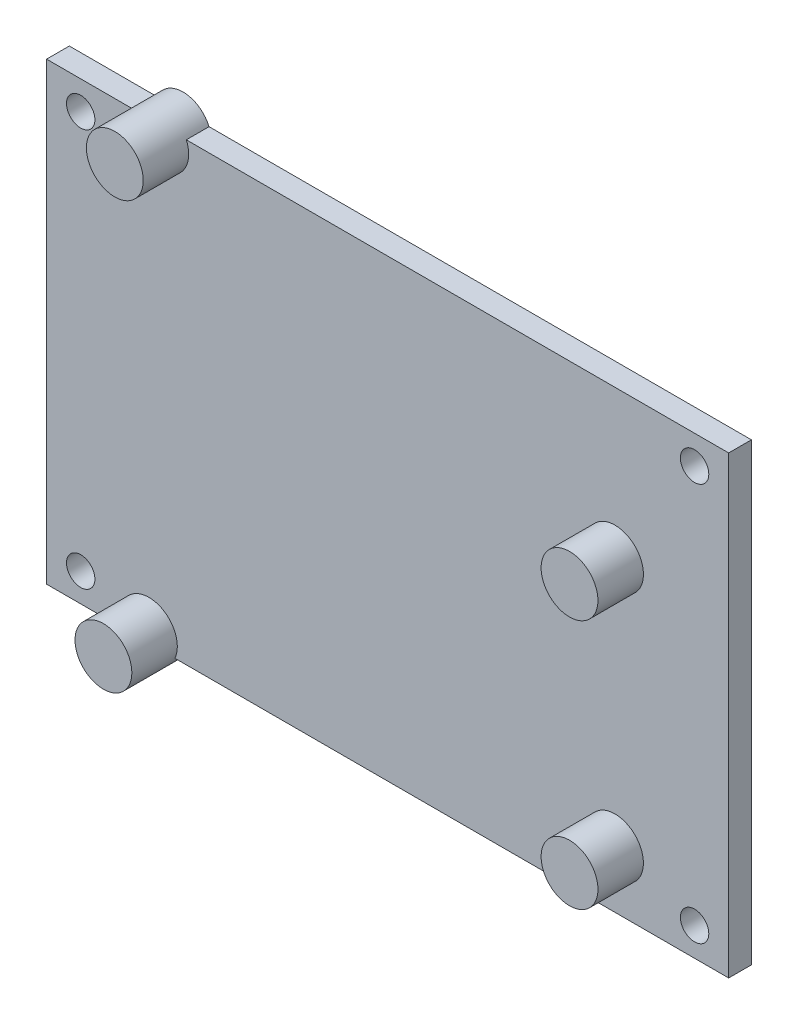
ISO-10303-21;
HEADER;
FILE_DESCRIPTION(('STEP AP214'),'2;1');
FILE_NAME('part.step','',(''),(''),'','','');
FILE_SCHEMA(('AUTOMOTIVE_DESIGN { 1 0 10303 214 1 1 1 1 }'));
ENDSEC;
DATA;
#1=APPLICATION_CONTEXT('core data for automotive mechanical design processes');
#2=APPLICATION_PROTOCOL_DEFINITION('international standard','automotive_design',2000,#1);
#3=PRODUCT_CONTEXT('',#1,'mechanical');
#4=PRODUCT('Part','Part','',(#3));
#5=PRODUCT_RELATED_PRODUCT_CATEGORY('part','',(#4));
#6=PRODUCT_DEFINITION_FORMATION('','',#4);
#7=PRODUCT_DEFINITION_CONTEXT('part definition',#1,'design');
#8=PRODUCT_DEFINITION('design','',#6,#7);
#9=PRODUCT_DEFINITION_SHAPE('','',#8);
#10=(LENGTH_UNIT() NAMED_UNIT(*) SI_UNIT(.MILLI.,.METRE.));
#11=(NAMED_UNIT(*) PLANE_ANGLE_UNIT() SI_UNIT($,.RADIAN.));
#12=(NAMED_UNIT(*) SI_UNIT($,.STERADIAN.) SOLID_ANGLE_UNIT());
#13=UNCERTAINTY_MEASURE_WITH_UNIT(LENGTH_MEASURE(1.E-05),#10,'distance_accuracy_value','');
#14=(GEOMETRIC_REPRESENTATION_CONTEXT(3) GLOBAL_UNCERTAINTY_ASSIGNED_CONTEXT((#13)) GLOBAL_UNIT_ASSIGNED_CONTEXT((#10,
#11,#12)) REPRESENTATION_CONTEXT('',''));
#15=CARTESIAN_POINT('',(0.,0.,0.));
#16=DIRECTION('',(0.,0.,1.));
#17=DIRECTION('',(1.,0.,0.));
#18=AXIS2_PLACEMENT_3D('',#15,#16,#17);
#19=CARTESIAN_POINT('',(-38.1,-25.4,2.54));
#20=DIRECTION('',(0.,1.,0.));
#21=DIRECTION('',(0.,0.,1.));
#22=AXIS2_PLACEMENT_3D('',#19,#20,#21);
#23=PLANE('',#22);
#24=DIRECTION('',(1.,0.,0.));
#25=VECTOR('',#24,1.);
#26=CARTESIAN_POINT('',(-38.1,-25.4,0.));
#27=LINE('',#26,#25);
#28=CARTESIAN_POINT('',(-38.1,-25.4,0.));
#29=VERTEX_POINT('',#28);
#30=CARTESIAN_POINT('',(-29.579935566297,-25.4,0.));
#31=VERTEX_POINT('',#30);
#32=EDGE_CURVE('E109',#29,#31,#27,.T.);
#33=ORIENTED_EDGE('',*,*,#32,.T.);
#34=DIRECTION('',(0.,0.,1.));
#35=VECTOR('',#34,1.);
#36=CARTESIAN_POINT('',(-29.579935566297,-25.4,0.));
#37=LINE('',#36,#35);
#38=CARTESIAN_POINT('',(-29.579935566297,-25.4,2.54));
#39=VERTEX_POINT('',#38);
#40=EDGE_CURVE('E11',#31,#39,#37,.T.);
#41=ORIENTED_EDGE('',*,*,#40,.T.);
#42=DIRECTION('',(1.,0.,0.));
#43=VECTOR('',#42,1.);
#44=CARTESIAN_POINT('',(-38.1,-25.4,2.54));
#45=LINE('',#44,#43);
#46=CARTESIAN_POINT('',(-38.1,-25.4,2.54));
#47=VERTEX_POINT('',#46);
#48=EDGE_CURVE('E167',#47,#39,#45,.T.);
#49=ORIENTED_EDGE('',*,*,#48,.F.);
#50=DIRECTION('',(0.,0.,-1.));
#51=VECTOR('',#50,1.);
#52=CARTESIAN_POINT('',(-38.1,-25.4,2.54));
#53=LINE('',#52,#51);
#54=EDGE_CURVE('E176',#47,#29,#53,.T.);
#55=ORIENTED_EDGE('',*,*,#54,.T.);
#56=EDGE_LOOP('',(#33,#41,#49,#55));
#57=FACE_BOUND('',#56,.T.);
#58=ADVANCED_FACE('F33',(#57),#23,.F.);
#59=CARTESIAN_POINT('',(-38.1,25.4,2.54));
#60=DIRECTION('',(0.,-1.,0.));
#61=DIRECTION('',(0.,0.,-1.));
#62=AXIS2_PLACEMENT_3D('',#59,#60,#61);
#63=PLANE('',#62);
#64=DIRECTION('',(-1.,0.,0.));
#65=VECTOR('',#64,1.);
#66=CARTESIAN_POINT('',(-38.1,25.4,0.));
#67=LINE('',#66,#65);
#68=CARTESIAN_POINT('',(38.1,25.4,0.));
#69=VERTEX_POINT('',#68);
#70=CARTESIAN_POINT('',(-22.490064433703,25.4,0.));
#71=VERTEX_POINT('',#70);
#72=EDGE_CURVE('E172',#69,#71,#67,.T.);
#73=ORIENTED_EDGE('',*,*,#72,.T.);
#74=DIRECTION('',(0.,0.,1.));
#75=VECTOR('',#74,1.);
#76=CARTESIAN_POINT('',(-22.490064433703,25.4,0.));
#77=LINE('',#76,#75);
#78=CARTESIAN_POINT('',(-22.490064433703,25.4,2.54));
#79=VERTEX_POINT('',#78);
#80=EDGE_CURVE('E116',#71,#79,#77,.T.);
#81=ORIENTED_EDGE('',*,*,#80,.T.);
#82=DIRECTION('',(-1.,0.,0.));
#83=VECTOR('',#82,1.);
#84=CARTESIAN_POINT('',(-38.1,25.4,2.54));
#85=LINE('',#84,#83);
#86=CARTESIAN_POINT('',(38.1,25.4,2.54));
#87=VERTEX_POINT('',#86);
#88=EDGE_CURVE('E162',#87,#79,#85,.T.);
#89=ORIENTED_EDGE('',*,*,#88,.F.);
#90=DIRECTION('',(0.,0.,-1.));
#91=VECTOR('',#90,1.);
#92=CARTESIAN_POINT('',(38.1,25.4,2.54));
#93=LINE('',#92,#91);
#94=EDGE_CURVE('E182',#87,#69,#93,.T.);
#95=ORIENTED_EDGE('',*,*,#94,.T.);
#96=EDGE_LOOP('',(#73,#81,#89,#95));
#97=FACE_BOUND('',#96,.T.);
#98=ADVANCED_FACE('F190',(#97),#63,.F.);
#99=CARTESIAN_POINT('',(0.,0.,2.54));
#100=DIRECTION('',(0.,0.,-1.));
#101=DIRECTION('',(-1.,0.,0.));
#102=AXIS2_PLACEMENT_3D('',#99,#100,#101);
#103=PLANE('',#102);
#104=CARTESIAN_POINT('',(25.4,-19.05,2.54));
#105=DIRECTION('',(0.,0.,-1.));
#106=DIRECTION('',(-1.,0.,0.));
#107=AXIS2_PLACEMENT_3D('',#104,#105,#106);
#108=CIRCLE('',#107,3.175);
#109=CARTESIAN_POINT('',(22.225,-19.05,2.54));
#110=VERTEX_POINT('',#109);
#111=EDGE_CURVE('E286',#110,#110,#108,.T.);
#112=ORIENTED_EDGE('',*,*,#111,.T.);
#113=EDGE_LOOP('',(#112));
#114=FACE_BOUND('',#113,.T.);
#115=CARTESIAN_POINT('',(25.4,8.89000000000001,2.54));
#116=DIRECTION('',(0.,0.,-1.));
#117=DIRECTION('',(-1.,0.,0.));
#118=AXIS2_PLACEMENT_3D('',#115,#116,#117);
#119=CIRCLE('',#118,3.17500000000001);
#120=CARTESIAN_POINT('',(22.225,8.89000000000001,2.54));
#121=VERTEX_POINT('',#120);
#122=EDGE_CURVE('E123',#121,#121,#119,.T.);
#123=ORIENTED_EDGE('',*,*,#122,.T.);
#124=EDGE_LOOP('',(#123));
#125=FACE_BOUND('',#124,.T.);
#126=ORIENTED_EDGE('',*,*,#48,.T.);
#127=CARTESIAN_POINT('',(-26.67,-24.13,2.54));
#128=DIRECTION('',(0.,0.,-1.));
#129=DIRECTION('',(-1.,0.,0.));
#130=AXIS2_PLACEMENT_3D('',#127,#128,#129);
#131=CIRCLE('',#130,3.175);
#132=CARTESIAN_POINT('',(-23.760064433703,-25.4,2.54));
#133=VERTEX_POINT('',#132);
#134=EDGE_CURVE('E48',#39,#133,#131,.T.);
#135=ORIENTED_EDGE('',*,*,#134,.T.);
#136=CARTESIAN_POINT('',(38.1,-25.4,2.54));
#137=VERTEX_POINT('',#136);
#138=EDGE_CURVE('E114',#133,#137,#45,.T.);
#139=ORIENTED_EDGE('',*,*,#138,.T.);
#140=DIRECTION('',(0.,1.,0.));
#141=VECTOR('',#140,1.);
#142=CARTESIAN_POINT('',(38.1,-25.4,2.54));
#143=LINE('',#142,#141);
#144=EDGE_CURVE('E158',#137,#87,#143,.T.);
#145=ORIENTED_EDGE('',*,*,#144,.T.);
#146=ORIENTED_EDGE('',*,*,#88,.T.);
#147=CARTESIAN_POINT('',(-25.4,24.13,2.54));
#148=DIRECTION('',(0.,0.,-1.));
#149=DIRECTION('',(-1.,0.,0.));
#150=AXIS2_PLACEMENT_3D('',#147,#148,#149);
#151=CIRCLE('',#150,3.175);
#152=CARTESIAN_POINT('',(-28.309935566297,25.4,2.54));
#153=VERTEX_POINT('',#152);
#154=EDGE_CURVE('E132',#79,#153,#151,.T.);
#155=ORIENTED_EDGE('',*,*,#154,.T.);
#156=CARTESIAN_POINT('',(-38.1,25.4,2.54));
#157=VERTEX_POINT('',#156);
#158=EDGE_CURVE('E161',#153,#157,#85,.T.);
#159=ORIENTED_EDGE('',*,*,#158,.T.);
#160=DIRECTION('',(0.,-1.,0.));
#161=VECTOR('',#160,1.);
#162=CARTESIAN_POINT('',(-38.1,-25.4,2.54));
#163=LINE('',#162,#161);
#164=EDGE_CURVE('E165',#157,#47,#163,.T.);
#165=ORIENTED_EDGE('',*,*,#164,.T.);
#166=EDGE_LOOP('',(#126,#135,#139,#145,#146,#155,#159,#165));
#167=FACE_BOUND('',#166,.T.);
#168=CARTESIAN_POINT('',(-34.29,22.225,2.54));
#169=DIRECTION('',(0.,0.,1.));
#170=DIRECTION('',(1.,0.,0.));
#171=AXIS2_PLACEMENT_3D('',#168,#169,#170);
#172=CIRCLE('',#171,1.5875);
#173=CARTESIAN_POINT('',(-32.7025,22.225,2.54));
#174=VERTEX_POINT('',#173);
#175=EDGE_CURVE('E153',#174,#174,#172,.T.);
#176=ORIENTED_EDGE('',*,*,#175,.F.);
#177=EDGE_LOOP('',(#176));
#178=FACE_BOUND('',#177,.T.);
#179=CARTESIAN_POINT('',(34.29,22.225,2.54));
#180=DIRECTION('',(0.,0.,1.));
#181=DIRECTION('',(1.,0.,0.));
#182=AXIS2_PLACEMENT_3D('',#179,#180,#181);
#183=CIRCLE('',#182,1.5875);
#184=CARTESIAN_POINT('',(35.8775,22.225,2.54));
#185=VERTEX_POINT('',#184);
#186=EDGE_CURVE('E147',#185,#185,#183,.T.);
#187=ORIENTED_EDGE('',*,*,#186,.F.);
#188=EDGE_LOOP('',(#187));
#189=FACE_BOUND('',#188,.T.);
#190=CARTESIAN_POINT('',(34.2900000000005,-22.225,2.54));
#191=DIRECTION('',(0.,0.,1.));
#192=DIRECTION('',(1.,0.,0.));
#193=AXIS2_PLACEMENT_3D('',#190,#191,#192);
#194=CIRCLE('',#193,1.5875);
#195=CARTESIAN_POINT('',(35.8775000000005,-22.225,2.54));
#196=VERTEX_POINT('',#195);
#197=EDGE_CURVE('E141',#196,#196,#194,.T.);
#198=ORIENTED_EDGE('',*,*,#197,.F.);
#199=EDGE_LOOP('',(#198));
#200=FACE_BOUND('',#199,.T.);
#201=CARTESIAN_POINT('',(-34.2899999999995,-22.225,2.54));
#202=DIRECTION('',(0.,0.,1.));
#203=DIRECTION('',(1.,0.,0.));
#204=AXIS2_PLACEMENT_3D('',#201,#202,#203);
#205=CIRCLE('',#204,1.5875);
#206=CARTESIAN_POINT('',(-32.7024999999995,-22.225,2.54));
#207=VERTEX_POINT('',#206);
#208=EDGE_CURVE('E135',#207,#207,#205,.T.);
#209=ORIENTED_EDGE('',*,*,#208,.F.);
#210=EDGE_LOOP('',(#209));
#211=FACE_BOUND('',#210,.T.);
#212=ADVANCED_FACE('F194',(#114,#125,#167,#178,#189,#200,#211),#103,.F.);
#213=CARTESIAN_POINT('',(0.,0.,0.));
#214=DIRECTION('',(0.,0.,-1.));
#215=DIRECTION('',(-1.,0.,0.));
#216=AXIS2_PLACEMENT_3D('',#213,#214,#215);
#217=PLANE('',#216);
#218=CARTESIAN_POINT('',(-23.760064433703,-25.4,0.));
#219=VERTEX_POINT('',#218);
#220=CARTESIAN_POINT('',(38.1,-25.4,0.));
#221=VERTEX_POINT('',#220);
#222=EDGE_CURVE('E97',#219,#221,#27,.T.);
#223=ORIENTED_EDGE('',*,*,#222,.F.);
#224=CARTESIAN_POINT('',(-26.67,-24.13,0.));
#225=DIRECTION('',(0.,0.,1.));
#226=DIRECTION('',(1.,0.,0.));
#227=AXIS2_PLACEMENT_3D('',#224,#225,#226);
#228=CIRCLE('',#227,3.175);
#229=EDGE_CURVE('E103',#31,#219,#228,.T.);
#230=ORIENTED_EDGE('',*,*,#229,.F.);
#231=ORIENTED_EDGE('',*,*,#32,.F.);
#232=DIRECTION('',(0.,-1.,0.));
#233=VECTOR('',#232,1.);
#234=CARTESIAN_POINT('',(-38.1,-25.4,0.));
#235=LINE('',#234,#233);
#236=CARTESIAN_POINT('',(-38.1,25.4,0.));
#237=VERTEX_POINT('',#236);
#238=EDGE_CURVE('E110',#237,#29,#235,.T.);
#239=ORIENTED_EDGE('',*,*,#238,.F.);
#240=CARTESIAN_POINT('',(-28.309935566297,25.4,0.));
#241=VERTEX_POINT('',#240);
#242=EDGE_CURVE('E171',#241,#237,#67,.T.);
#243=ORIENTED_EDGE('',*,*,#242,.F.);
#244=CARTESIAN_POINT('',(-25.4,24.13,0.));
#245=DIRECTION('',(0.,0.,1.));
#246=DIRECTION('',(1.,0.,0.));
#247=AXIS2_PLACEMENT_3D('',#244,#245,#246);
#248=CIRCLE('',#247,3.175);
#249=EDGE_CURVE('E129',#71,#241,#248,.T.);
#250=ORIENTED_EDGE('',*,*,#249,.F.);
#251=ORIENTED_EDGE('',*,*,#72,.F.);
#252=DIRECTION('',(0.,1.,0.));
#253=VECTOR('',#252,1.);
#254=CARTESIAN_POINT('',(38.1,-25.4,0.));
#255=LINE('',#254,#253);
#256=EDGE_CURVE('E105',#221,#69,#255,.T.);
#257=ORIENTED_EDGE('',*,*,#256,.F.);
#258=EDGE_LOOP('',(#223,#230,#231,#239,#243,#250,#251,#257));
#259=FACE_BOUND('',#258,.T.);
#260=CARTESIAN_POINT('',(34.2900000000005,-22.225,0.));
#261=DIRECTION('',(0.,0.,1.));
#262=DIRECTION('',(1.,0.,0.));
#263=AXIS2_PLACEMENT_3D('',#260,#261,#262);
#264=CIRCLE('',#263,1.5875);
#265=CARTESIAN_POINT('',(35.8775000000005,-22.225,0.));
#266=VERTEX_POINT('',#265);
#267=EDGE_CURVE('E138',#266,#266,#264,.T.);
#268=ORIENTED_EDGE('',*,*,#267,.T.);
#269=EDGE_LOOP('',(#268));
#270=FACE_BOUND('',#269,.T.);
#271=CARTESIAN_POINT('',(-34.29,22.225,0.));
#272=DIRECTION('',(0.,0.,1.));
#273=DIRECTION('',(1.,0.,0.));
#274=AXIS2_PLACEMENT_3D('',#271,#272,#273);
#275=CIRCLE('',#274,1.5875);
#276=CARTESIAN_POINT('',(-32.7025,22.225,0.));
#277=VERTEX_POINT('',#276);
#278=EDGE_CURVE('E150',#277,#277,#275,.T.);
#279=ORIENTED_EDGE('',*,*,#278,.T.);
#280=EDGE_LOOP('',(#279));
#281=FACE_BOUND('',#280,.T.);
#282=CARTESIAN_POINT('',(34.29,22.225,0.));
#283=DIRECTION('',(0.,0.,1.));
#284=DIRECTION('',(1.,0.,0.));
#285=AXIS2_PLACEMENT_3D('',#282,#283,#284);
#286=CIRCLE('',#285,1.5875);
#287=CARTESIAN_POINT('',(35.8775,22.225,0.));
#288=VERTEX_POINT('',#287);
#289=EDGE_CURVE('E144',#288,#288,#286,.T.);
#290=ORIENTED_EDGE('',*,*,#289,.T.);
#291=EDGE_LOOP('',(#290));
#292=FACE_BOUND('',#291,.T.);
#293=CARTESIAN_POINT('',(-34.2899999999995,-22.225,0.));
#294=DIRECTION('',(0.,0.,1.));
#295=DIRECTION('',(1.,0.,0.));
#296=AXIS2_PLACEMENT_3D('',#293,#294,#295);
#297=CIRCLE('',#296,1.5875);
#298=CARTESIAN_POINT('',(-32.7024999999995,-22.225,0.));
#299=VERTEX_POINT('',#298);
#300=EDGE_CURVE('E134',#299,#299,#297,.T.);
#301=ORIENTED_EDGE('',*,*,#300,.T.);
#302=EDGE_LOOP('',(#301));
#303=FACE_BOUND('',#302,.T.);
#304=ADVANCED_FACE('F99',(#259,#270,#281,#292,#303),#217,.T.);
#305=CARTESIAN_POINT('',(38.1,-25.4,2.54));
#306=DIRECTION('',(-1.,0.,0.));
#307=DIRECTION('',(0.,0.,1.));
#308=AXIS2_PLACEMENT_3D('',#305,#306,#307);
#309=PLANE('',#308);
#310=ORIENTED_EDGE('',*,*,#256,.T.);
#311=ORIENTED_EDGE('',*,*,#94,.F.);
#312=ORIENTED_EDGE('',*,*,#144,.F.);
#313=DIRECTION('',(0.,0.,-1.));
#314=VECTOR('',#313,1.);
#315=CARTESIAN_POINT('',(38.1,-25.4,2.54));
#316=LINE('',#315,#314);
#317=EDGE_CURVE('E169',#137,#221,#316,.T.);
#318=ORIENTED_EDGE('',*,*,#317,.T.);
#319=EDGE_LOOP('',(#310,#311,#312,#318));
#320=FACE_BOUND('',#319,.T.);
#321=ADVANCED_FACE('F35',(#320),#309,.F.);
#322=ORIENTED_EDGE('',*,*,#158,.F.);
#323=DIRECTION('',(0.,0.,1.));
#324=VECTOR('',#323,1.);
#325=CARTESIAN_POINT('',(-28.309935566297,25.4,0.));
#326=LINE('',#325,#324);
#327=EDGE_CURVE('E185',#153,#241,#326,.F.);
#328=ORIENTED_EDGE('',*,*,#327,.T.);
#329=ORIENTED_EDGE('',*,*,#242,.T.);
#330=DIRECTION('',(0.,0.,-1.));
#331=VECTOR('',#330,1.);
#332=CARTESIAN_POINT('',(-38.1,25.4,2.54));
#333=LINE('',#332,#331);
#334=EDGE_CURVE('E179',#157,#237,#333,.T.);
#335=ORIENTED_EDGE('',*,*,#334,.F.);
#336=EDGE_LOOP('',(#322,#328,#329,#335));
#337=FACE_BOUND('',#336,.T.);
#338=ADVANCED_FACE('F202',(#337),#63,.F.);
#339=CARTESIAN_POINT('',(-38.1,-25.4,2.54));
#340=DIRECTION('',(1.,0.,0.));
#341=DIRECTION('',(0.,0.,-1.));
#342=AXIS2_PLACEMENT_3D('',#339,#340,#341);
#343=PLANE('',#342);
#344=ORIENTED_EDGE('',*,*,#238,.T.);
#345=ORIENTED_EDGE('',*,*,#54,.F.);
#346=ORIENTED_EDGE('',*,*,#164,.F.);
#347=ORIENTED_EDGE('',*,*,#334,.T.);
#348=EDGE_LOOP('',(#344,#345,#346,#347));
#349=FACE_BOUND('',#348,.T.);
#350=ADVANCED_FACE('F207',(#349),#343,.F.);
#351=ORIENTED_EDGE('',*,*,#138,.F.);
#352=DIRECTION('',(0.,0.,1.));
#353=VECTOR('',#352,1.);
#354=CARTESIAN_POINT('',(-23.760064433703,-25.4,0.));
#355=LINE('',#354,#353);
#356=EDGE_CURVE('E41',#133,#219,#355,.F.);
#357=ORIENTED_EDGE('',*,*,#356,.T.);
#358=ORIENTED_EDGE('',*,*,#222,.T.);
#359=ORIENTED_EDGE('',*,*,#317,.F.);
#360=EDGE_LOOP('',(#351,#357,#358,#359));
#361=FACE_BOUND('',#360,.T.);
#362=ADVANCED_FACE('F113',(#361),#23,.F.);
#363=CARTESIAN_POINT('',(-34.29,22.225,2.54));
#364=DIRECTION('',(0.,0.,-1.));
#365=DIRECTION('',(-1.,0.,0.));
#366=AXIS2_PLACEMENT_3D('',#363,#364,#365);
#367=CYLINDRICAL_SURFACE('',#366,1.5875);
#368=ORIENTED_EDGE('',*,*,#175,.T.);
#369=EDGE_LOOP('',(#368));
#370=FACE_BOUND('',#369,.T.);
#371=ORIENTED_EDGE('',*,*,#278,.F.);
#372=EDGE_LOOP('',(#371));
#373=FACE_BOUND('',#372,.T.);
#374=ADVANCED_FACE('F217',(#370,#373),#367,.F.);
#375=CARTESIAN_POINT('',(34.29,22.225,2.54));
#376=DIRECTION('',(0.,0.,-1.));
#377=DIRECTION('',(-1.,0.,0.));
#378=AXIS2_PLACEMENT_3D('',#375,#376,#377);
#379=CYLINDRICAL_SURFACE('',#378,1.5875);
#380=ORIENTED_EDGE('',*,*,#186,.T.);
#381=EDGE_LOOP('',(#380));
#382=FACE_BOUND('',#381,.T.);
#383=ORIENTED_EDGE('',*,*,#289,.F.);
#384=EDGE_LOOP('',(#383));
#385=FACE_BOUND('',#384,.T.);
#386=ADVANCED_FACE('F222',(#382,#385),#379,.F.);
#387=CARTESIAN_POINT('',(34.2900000000005,-22.225,2.54));
#388=DIRECTION('',(0.,0.,-1.));
#389=DIRECTION('',(-1.,0.,0.));
#390=AXIS2_PLACEMENT_3D('',#387,#388,#389);
#391=CYLINDRICAL_SURFACE('',#390,1.5875);
#392=ORIENTED_EDGE('',*,*,#197,.T.);
#393=EDGE_LOOP('',(#392));
#394=FACE_BOUND('',#393,.T.);
#395=ORIENTED_EDGE('',*,*,#267,.F.);
#396=EDGE_LOOP('',(#395));
#397=FACE_BOUND('',#396,.T.);
#398=ADVANCED_FACE('F243',(#394,#397),#391,.F.);
#399=CARTESIAN_POINT('',(-34.2899999999995,-22.225,2.54));
#400=DIRECTION('',(0.,0.,-1.));
#401=DIRECTION('',(-1.,0.,0.));
#402=AXIS2_PLACEMENT_3D('',#399,#400,#401);
#403=CYLINDRICAL_SURFACE('',#402,1.5875);
#404=ORIENTED_EDGE('',*,*,#208,.T.);
#405=EDGE_LOOP('',(#404));
#406=FACE_BOUND('',#405,.T.);
#407=ORIENTED_EDGE('',*,*,#300,.F.);
#408=EDGE_LOOP('',(#407));
#409=FACE_BOUND('',#408,.T.);
#410=ADVANCED_FACE('F247',(#406,#409),#403,.F.);
#411=CARTESIAN_POINT('',(-25.4,24.13,0.));
#412=DIRECTION('',(0.,0.,1.));
#413=DIRECTION('',(1.,0.,0.));
#414=AXIS2_PLACEMENT_3D('',#411,#412,#413);
#415=CYLINDRICAL_SURFACE('',#414,3.175);
#416=CARTESIAN_POINT('',(-25.4,24.13,7.62));
#417=DIRECTION('',(0.,0.,1.));
#418=DIRECTION('',(1.,0.,0.));
#419=AXIS2_PLACEMENT_3D('',#416,#417,#418);
#420=CIRCLE('',#419,3.175);
#421=CARTESIAN_POINT('',(-22.225,24.13,7.62));
#422=VERTEX_POINT('',#421);
#423=EDGE_CURVE('E120',#422,#422,#420,.T.);
#424=ORIENTED_EDGE('',*,*,#423,.F.);
#425=EDGE_LOOP('',(#424));
#426=FACE_BOUND('',#425,.T.);
#427=ORIENTED_EDGE('',*,*,#80,.F.);
#428=ORIENTED_EDGE('',*,*,#249,.T.);
#429=ORIENTED_EDGE('',*,*,#327,.F.);
#430=ORIENTED_EDGE('',*,*,#154,.F.);
#431=EDGE_LOOP('',(#427,#428,#429,#430));
#432=FACE_BOUND('',#431,.T.);
#433=ADVANCED_FACE('F200',(#426,#432),#415,.T.);
#434=CARTESIAN_POINT('',(-25.4,24.13,7.62));
#435=DIRECTION('',(0.,0.,1.));
#436=DIRECTION('',(1.,0.,0.));
#437=AXIS2_PLACEMENT_3D('',#434,#435,#436);
#438=PLANE('',#437);
#439=ORIENTED_EDGE('',*,*,#423,.T.);
#440=EDGE_LOOP('',(#439));
#441=FACE_BOUND('',#440,.T.);
#442=ADVANCED_FACE('F254',(#441),#438,.T.);
#443=CARTESIAN_POINT('',(-26.67,-24.13,0.));
#444=DIRECTION('',(0.,0.,1.));
#445=DIRECTION('',(1.,0.,0.));
#446=AXIS2_PLACEMENT_3D('',#443,#444,#445);
#447=CYLINDRICAL_SURFACE('',#446,3.175);
#448=CARTESIAN_POINT('',(-26.67,-24.13,7.62));
#449=DIRECTION('',(0.,0.,1.));
#450=DIRECTION('',(1.,0.,0.));
#451=AXIS2_PLACEMENT_3D('',#448,#449,#450);
#452=CIRCLE('',#451,3.175);
#453=CARTESIAN_POINT('',(-23.495,-24.13,7.62));
#454=VERTEX_POINT('',#453);
#455=EDGE_CURVE('E118',#454,#454,#452,.T.);
#456=ORIENTED_EDGE('',*,*,#455,.F.);
#457=EDGE_LOOP('',(#456));
#458=FACE_BOUND('',#457,.T.);
#459=ORIENTED_EDGE('',*,*,#40,.F.);
#460=ORIENTED_EDGE('',*,*,#229,.T.);
#461=ORIENTED_EDGE('',*,*,#356,.F.);
#462=ORIENTED_EDGE('',*,*,#134,.F.);
#463=EDGE_LOOP('',(#459,#460,#461,#462));
#464=FACE_BOUND('',#463,.T.);
#465=ADVANCED_FACE('F117',(#458,#464),#447,.T.);
#466=CARTESIAN_POINT('',(-26.67,-24.13,7.62));
#467=DIRECTION('',(0.,0.,1.));
#468=DIRECTION('',(1.,0.,0.));
#469=AXIS2_PLACEMENT_3D('',#466,#467,#468);
#470=PLANE('',#469);
#471=ORIENTED_EDGE('',*,*,#455,.T.);
#472=EDGE_LOOP('',(#471));
#473=FACE_BOUND('',#472,.T.);
#474=ADVANCED_FACE('F261',(#473),#470,.T.);
#475=CARTESIAN_POINT('',(25.4,8.89000000000001,0.));
#476=DIRECTION('',(0.,0.,1.));
#477=DIRECTION('',(1.,0.,0.));
#478=AXIS2_PLACEMENT_3D('',#475,#476,#477);
#479=CYLINDRICAL_SURFACE('',#478,3.17500000000001);
#480=CARTESIAN_POINT('',(25.4,8.89000000000001,7.62));
#481=DIRECTION('',(0.,0.,1.));
#482=DIRECTION('',(1.,0.,0.));
#483=AXIS2_PLACEMENT_3D('',#480,#481,#482);
#484=CIRCLE('',#483,3.17500000000001);
#485=CARTESIAN_POINT('',(28.575,8.89000000000001,7.62));
#486=VERTEX_POINT('',#485);
#487=EDGE_CURVE('E289',#486,#486,#484,.T.);
#488=ORIENTED_EDGE('',*,*,#487,.F.);
#489=EDGE_LOOP('',(#488));
#490=FACE_BOUND('',#489,.T.);
#491=ORIENTED_EDGE('',*,*,#122,.F.);
#492=EDGE_LOOP('',(#491));
#493=FACE_BOUND('',#492,.T.);
#494=ADVANCED_FACE('F265',(#490,#493),#479,.T.);
#495=CARTESIAN_POINT('',(25.4,8.89000000000001,7.62));
#496=DIRECTION('',(0.,0.,1.));
#497=DIRECTION('',(1.,0.,0.));
#498=AXIS2_PLACEMENT_3D('',#495,#496,#497);
#499=PLANE('',#498);
#500=ORIENTED_EDGE('',*,*,#487,.T.);
#501=EDGE_LOOP('',(#500));
#502=FACE_BOUND('',#501,.T.);
#503=ADVANCED_FACE('F269',(#502),#499,.T.);
#504=CARTESIAN_POINT('',(25.4,-19.05,0.));
#505=DIRECTION('',(0.,0.,1.));
#506=DIRECTION('',(1.,0.,0.));
#507=AXIS2_PLACEMENT_3D('',#504,#505,#506);
#508=CYLINDRICAL_SURFACE('',#507,3.175);
#509=CARTESIAN_POINT('',(25.4,-19.05,7.62));
#510=DIRECTION('',(0.,0.,1.));
#511=DIRECTION('',(1.,0.,0.));
#512=AXIS2_PLACEMENT_3D('',#509,#510,#511);
#513=CIRCLE('',#512,3.175);
#514=CARTESIAN_POINT('',(28.575,-19.05,7.62));
#515=VERTEX_POINT('',#514);
#516=EDGE_CURVE('E285',#515,#515,#513,.T.);
#517=ORIENTED_EDGE('',*,*,#516,.F.);
#518=EDGE_LOOP('',(#517));
#519=FACE_BOUND('',#518,.T.);
#520=ORIENTED_EDGE('',*,*,#111,.F.);
#521=EDGE_LOOP('',(#520));
#522=FACE_BOUND('',#521,.T.);
#523=ADVANCED_FACE('F273',(#519,#522),#508,.T.);
#524=CARTESIAN_POINT('',(25.4,-19.05,7.62));
#525=DIRECTION('',(0.,0.,1.));
#526=DIRECTION('',(1.,0.,0.));
#527=AXIS2_PLACEMENT_3D('',#524,#525,#526);
#528=PLANE('',#527);
#529=ORIENTED_EDGE('',*,*,#516,.T.);
#530=EDGE_LOOP('',(#529));
#531=FACE_BOUND('',#530,.T.);
#532=ADVANCED_FACE('F277',(#531),#528,.T.);
#533=CLOSED_SHELL('',(#58,#98,#212,#304,#321,#338,#350,#362,#374,#386,#398,#410,#433,#442,#465,
#474,#494,#503,#523,#532));
#534=MANIFOLD_SOLID_BREP('B2',#533);
#535=ADVANCED_BREP_SHAPE_REPRESENTATION('',(#18,#534),#14);
#536=SHAPE_DEFINITION_REPRESENTATION(#9,#535);
ENDSEC;
END-ISO-10303-21;
